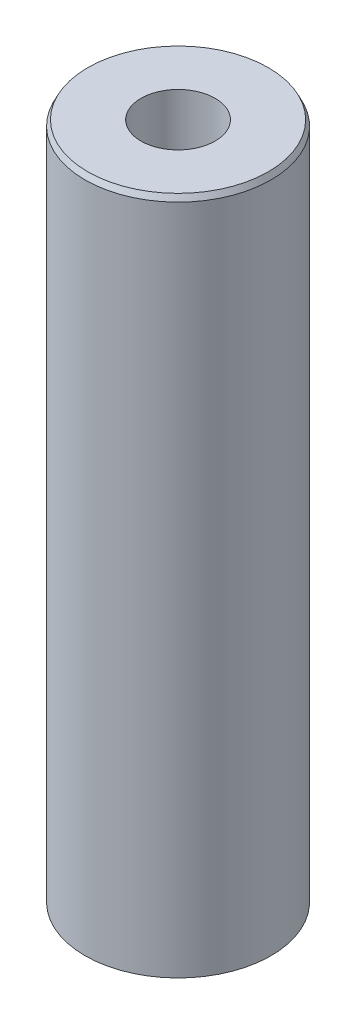
ISO-10303-21;
HEADER;
FILE_DESCRIPTION(('STEP AP214'),'2;1');
FILE_NAME('part.step','',(''),(''),'','','');
FILE_SCHEMA(('AUTOMOTIVE_DESIGN { 1 0 10303 214 1 1 1 1 }'));
ENDSEC;
DATA;
#1=APPLICATION_CONTEXT('core data for automotive mechanical design processes');
#2=APPLICATION_PROTOCOL_DEFINITION('international standard','automotive_design',2000,#1);
#3=PRODUCT_CONTEXT('',#1,'mechanical');
#4=PRODUCT('Part','Part','',(#3));
#5=PRODUCT_RELATED_PRODUCT_CATEGORY('part','',(#4));
#6=PRODUCT_DEFINITION_FORMATION('','',#4);
#7=PRODUCT_DEFINITION_CONTEXT('part definition',#1,'design');
#8=PRODUCT_DEFINITION('design','',#6,#7);
#9=PRODUCT_DEFINITION_SHAPE('','',#8);
#10=(LENGTH_UNIT() NAMED_UNIT(*) SI_UNIT(.MILLI.,.METRE.));
#11=(NAMED_UNIT(*) PLANE_ANGLE_UNIT() SI_UNIT($,.RADIAN.));
#12=(NAMED_UNIT(*) SI_UNIT($,.STERADIAN.) SOLID_ANGLE_UNIT());
#13=UNCERTAINTY_MEASURE_WITH_UNIT(LENGTH_MEASURE(1.E-05),#10,'distance_accuracy_value','');
#14=(GEOMETRIC_REPRESENTATION_CONTEXT(3) GLOBAL_UNCERTAINTY_ASSIGNED_CONTEXT((#13)) GLOBAL_UNIT_ASSIGNED_CONTEXT((#10,
#11,#12)) REPRESENTATION_CONTEXT('',''));
#15=CARTESIAN_POINT('',(0.,0.,0.));
#16=DIRECTION('',(0.,0.,1.));
#17=DIRECTION('',(1.,0.,0.));
#18=AXIS2_PLACEMENT_3D('',#15,#16,#17);
#19=CARTESIAN_POINT('',(0.,402.264997528554,0.));
#20=DIRECTION('',(0.,-1.,0.));
#21=DIRECTION('',(0.,0.,-1.));
#22=AXIS2_PLACEMENT_3D('',#19,#20,#21);
#23=CYLINDRICAL_SURFACE('',#22,55.);
#24=CARTESIAN_POINT('',(0.,398.923122138655,0.));
#25=DIRECTION('',(0.,1.,0.));
#26=DIRECTION('',(0.,0.,1.));
#27=AXIS2_PLACEMENT_3D('',#24,#25,#26);
#28=CIRCLE('',#27,55.);
#29=CARTESIAN_POINT('',(0.,398.923122138655,55.));
#30=VERTEX_POINT('',#29);
#31=EDGE_CURVE('E50',#30,#30,#28,.F.);
#32=ORIENTED_EDGE('',*,*,#31,.T.);
#33=EDGE_LOOP('',(#32));
#34=FACE_BOUND('',#33,.T.);
#35=CARTESIAN_POINT('',(0.,1.6328448963534,0.));
#36=DIRECTION('',(0.,1.,0.));
#37=DIRECTION('',(0.,0.,1.));
#38=AXIS2_PLACEMENT_3D('',#35,#36,#37);
#39=CIRCLE('',#38,55.);
#40=CARTESIAN_POINT('',(0.,1.6328448963534,55.));
#41=VERTEX_POINT('',#40);
#42=EDGE_CURVE('E51',#41,#41,#39,.T.);
#43=ORIENTED_EDGE('',*,*,#42,.T.);
#44=EDGE_LOOP('',(#43));
#45=FACE_BOUND('',#44,.T.);
#46=ADVANCED_FACE('F39',(#34,#45),#23,.T.);
#47=CARTESIAN_POINT('',(0.,402.264997528554,0.));
#48=DIRECTION('',(0.,1.,0.));
#49=DIRECTION('',(0.,0.,1.));
#50=AXIS2_PLACEMENT_3D('',#47,#48,#49);
#51=PLANE('',#50);
#52=CARTESIAN_POINT('',(0.,402.264997528554,0.));
#53=DIRECTION('',(0.,1.,0.));
#54=DIRECTION('',(0.,0.,1.));
#55=AXIS2_PLACEMENT_3D('',#52,#53,#54);
#56=CIRCLE('',#55,53.3671551036466);
#57=CARTESIAN_POINT('',(0.,402.264997528554,53.3671551036466));
#58=VERTEX_POINT('',#57);
#59=EDGE_CURVE('E54',#58,#58,#56,.T.);
#60=ORIENTED_EDGE('',*,*,#59,.T.);
#61=EDGE_LOOP('',(#60));
#62=FACE_BOUND('',#61,.T.);
#63=CARTESIAN_POINT('',(0.,402.264997528554,0.));
#64=DIRECTION('',(0.,1.,0.));
#65=DIRECTION('',(0.,0.,1.));
#66=AXIS2_PLACEMENT_3D('',#63,#64,#65);
#67=CIRCLE('',#66,21.9276116435573);
#68=CARTESIAN_POINT('',(0.,402.264997528554,21.9276116435573));
#69=VERTEX_POINT('',#68);
#70=EDGE_CURVE('E58',#69,#69,#67,.T.);
#71=ORIENTED_EDGE('',*,*,#70,.F.);
#72=EDGE_LOOP('',(#71));
#73=FACE_BOUND('',#72,.T.);
#74=ADVANCED_FACE('F69',(#62,#73),#51,.T.);
#75=CARTESIAN_POINT('',(0.,0.,0.));
#76=DIRECTION('',(0.,1.,0.));
#77=DIRECTION('',(0.,0.,1.));
#78=AXIS2_PLACEMENT_3D('',#75,#76,#77);
#79=PLANE('',#78);
#80=CARTESIAN_POINT('',(0.,0.,0.));
#81=DIRECTION('',(0.,1.,0.));
#82=DIRECTION('',(0.,0.,1.));
#83=AXIS2_PLACEMENT_3D('',#80,#81,#82);
#84=CIRCLE('',#83,51.6581246101008);
#85=CARTESIAN_POINT('',(0.,0.,51.6581246101008));
#86=VERTEX_POINT('',#85);
#87=EDGE_CURVE('E10',#86,#86,#84,.F.);
#88=ORIENTED_EDGE('',*,*,#87,.T.);
#89=EDGE_LOOP('',(#88));
#90=FACE_BOUND('',#89,.T.);
#91=CARTESIAN_POINT('',(0.,0.,0.));
#92=DIRECTION('',(0.,1.,0.));
#93=DIRECTION('',(0.,0.,1.));
#94=AXIS2_PLACEMENT_3D('',#91,#92,#93);
#95=CIRCLE('',#94,21.9276116435573);
#96=CARTESIAN_POINT('',(0.,0.,21.9276116435573));
#97=VERTEX_POINT('',#96);
#98=EDGE_CURVE('E63',#97,#97,#95,.T.);
#99=ORIENTED_EDGE('',*,*,#98,.T.);
#100=EDGE_LOOP('',(#99));
#101=FACE_BOUND('',#100,.T.);
#102=ADVANCED_FACE('F75',(#90,#101),#79,.F.);
#103=CARTESIAN_POINT('',(0.,402.264997528554,0.));
#104=DIRECTION('',(0.,-1.,0.));
#105=DIRECTION('',(0.,0.,-1.));
#106=AXIS2_PLACEMENT_3D('',#103,#104,#105);
#107=CYLINDRICAL_SURFACE('',#106,21.9276116435573);
#108=ORIENTED_EDGE('',*,*,#70,.T.);
#109=EDGE_LOOP('',(#108));
#110=FACE_BOUND('',#109,.T.);
#111=ORIENTED_EDGE('',*,*,#98,.F.);
#112=EDGE_LOOP('',(#111));
#113=FACE_BOUND('',#112,.T.);
#114=ADVANCED_FACE('F70',(#110,#113),#107,.F.);
#115=CARTESIAN_POINT('',(0.,402.264997528554,0.));
#116=DIRECTION('',(0.,-1.,0.));
#117=DIRECTION('',(0.,0.,-1.));
#118=AXIS2_PLACEMENT_3D('',#115,#116,#117);
#119=CONICAL_SURFACE('',#118,53.3671551036466,0.454487194192331);
#120=ORIENTED_EDGE('',*,*,#31,.F.);
#121=EDGE_LOOP('',(#120));
#122=FACE_BOUND('',#121,.T.);
#123=ORIENTED_EDGE('',*,*,#59,.F.);
#124=EDGE_LOOP('',(#123));
#125=FACE_BOUND('',#124,.T.);
#126=ADVANCED_FACE('F81',(#122,#125),#119,.T.);
#127=CARTESIAN_POINT('',(0.,1.6328448963534,0.));
#128=DIRECTION('',(0.,1.,0.));
#129=DIRECTION('',(0.,0.,1.));
#130=AXIS2_PLACEMENT_3D('',#127,#128,#129);
#131=CONICAL_SURFACE('',#130,55.,1.11630913260258);
#132=ORIENTED_EDGE('',*,*,#87,.F.);
#133=EDGE_LOOP('',(#132));
#134=FACE_BOUND('',#133,.T.);
#135=ORIENTED_EDGE('',*,*,#42,.F.);
#136=EDGE_LOOP('',(#135));
#137=FACE_BOUND('',#136,.T.);
#138=ADVANCED_FACE('F45',(#134,#137),#131,.T.);
#139=CLOSED_SHELL('',(#46,#74,#102,#114,#126,#138));
#140=MANIFOLD_SOLID_BREP('B2',#139);
#141=ADVANCED_BREP_SHAPE_REPRESENTATION('',(#18,#140),#14);
#142=SHAPE_DEFINITION_REPRESENTATION(#9,#141);
ENDSEC;
END-ISO-10303-21;
